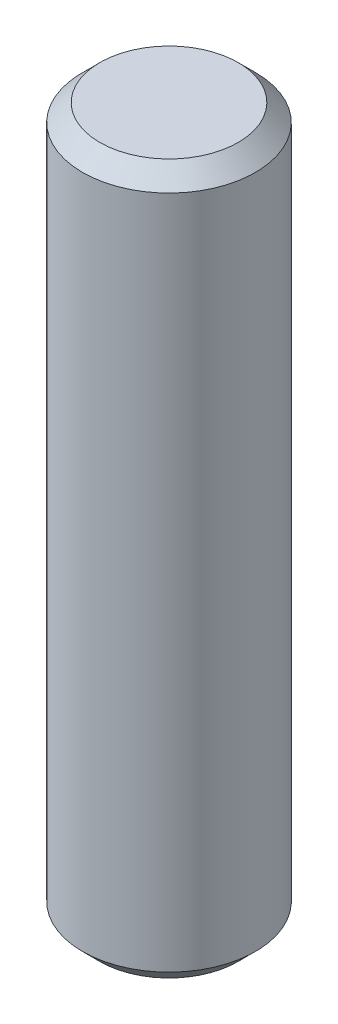
ISO-10303-21;
HEADER;
FILE_DESCRIPTION(('STEP AP214'),'2;1');
FILE_NAME('part.step','',(''),(''),'','','');
FILE_SCHEMA(('AUTOMOTIVE_DESIGN { 1 0 10303 214 1 1 1 1 }'));
ENDSEC;
DATA;
#1=APPLICATION_CONTEXT('core data for automotive mechanical design processes');
#2=APPLICATION_PROTOCOL_DEFINITION('international standard','automotive_design',2000,#1);
#3=PRODUCT_CONTEXT('',#1,'mechanical');
#4=PRODUCT('Part','Part','',(#3));
#5=PRODUCT_RELATED_PRODUCT_CATEGORY('part','',(#4));
#6=PRODUCT_DEFINITION_FORMATION('','',#4);
#7=PRODUCT_DEFINITION_CONTEXT('part definition',#1,'design');
#8=PRODUCT_DEFINITION('design','',#6,#7);
#9=PRODUCT_DEFINITION_SHAPE('','',#8);
#10=(LENGTH_UNIT() NAMED_UNIT(*) SI_UNIT(.MILLI.,.METRE.));
#11=(NAMED_UNIT(*) PLANE_ANGLE_UNIT() SI_UNIT($,.RADIAN.));
#12=(NAMED_UNIT(*) SI_UNIT($,.STERADIAN.) SOLID_ANGLE_UNIT());
#13=UNCERTAINTY_MEASURE_WITH_UNIT(LENGTH_MEASURE(1.E-05),#10,'distance_accuracy_value','');
#14=(GEOMETRIC_REPRESENTATION_CONTEXT(3) GLOBAL_UNCERTAINTY_ASSIGNED_CONTEXT((#13)) GLOBAL_UNIT_ASSIGNED_CONTEXT((#10,
#11,#12)) REPRESENTATION_CONTEXT('',''));
#15=CARTESIAN_POINT('',(0.,0.,0.));
#16=DIRECTION('',(0.,0.,1.));
#17=DIRECTION('',(1.,0.,0.));
#18=AXIS2_PLACEMENT_3D('',#15,#16,#17);
#19=CARTESIAN_POINT('',(4.,0.,0.));
#20=DIRECTION('',(0.,1.,0.));
#21=DIRECTION('',(0.,0.,1.));
#22=AXIS2_PLACEMENT_3D('',#19,#20,#21);
#23=PLANE('',#22);
#24=CARTESIAN_POINT('',(0.,0.,0.));
#25=DIRECTION('',(0.,1.,0.));
#26=DIRECTION('',(0.,0.,1.));
#27=AXIS2_PLACEMENT_3D('',#24,#25,#26);
#28=CIRCLE('',#27,4.);
#29=CARTESIAN_POINT('',(0.,0.,4.));
#30=VERTEX_POINT('',#29);
#31=EDGE_CURVE('E57',#30,#30,#28,.T.);
#32=ORIENTED_EDGE('',*,*,#31,.F.);
#33=EDGE_LOOP('',(#32));
#34=FACE_BOUND('',#33,.T.);
#35=ADVANCED_FACE('F43',(#34),#23,.F.);
#36=CARTESIAN_POINT('',(0.,41.,0.));
#37=DIRECTION('',(0.,-1.,0.));
#38=DIRECTION('',(0.,0.,-1.));
#39=AXIS2_PLACEMENT_3D('',#36,#37,#38);
#40=PLANE('',#39);
#41=CARTESIAN_POINT('',(0.,41.,0.));
#42=DIRECTION('',(0.,1.,0.));
#43=DIRECTION('',(0.,0.,1.));
#44=AXIS2_PLACEMENT_3D('',#41,#42,#43);
#45=CIRCLE('',#44,3.99999999999999);
#46=CARTESIAN_POINT('',(0.,41.,3.99999999999999));
#47=VERTEX_POINT('',#46);
#48=EDGE_CURVE('E10',#47,#47,#45,.T.);
#49=ORIENTED_EDGE('',*,*,#48,.T.);
#50=EDGE_LOOP('',(#49));
#51=FACE_BOUND('',#50,.T.);
#52=ADVANCED_FACE('F66',(#51),#40,.F.);
#53=CARTESIAN_POINT('',(0.,40.,0.));
#54=DIRECTION('',(0.,-1.,0.));
#55=DIRECTION('',(0.,0.,-1.));
#56=AXIS2_PLACEMENT_3D('',#53,#54,#55);
#57=CONICAL_SURFACE('',#56,4.99999999999999,0.785398163397447);
#58=ORIENTED_EDGE('',*,*,#48,.F.);
#59=EDGE_LOOP('',(#58));
#60=FACE_BOUND('',#59,.T.);
#61=CARTESIAN_POINT('',(0.,40.,0.));
#62=DIRECTION('',(0.,1.,0.));
#63=DIRECTION('',(0.,0.,1.));
#64=AXIS2_PLACEMENT_3D('',#61,#62,#63);
#65=CIRCLE('',#64,4.99999999999999);
#66=CARTESIAN_POINT('',(0.,40.,4.99999999999999));
#67=VERTEX_POINT('',#66);
#68=EDGE_CURVE('E49',#67,#67,#65,.T.);
#69=ORIENTED_EDGE('',*,*,#68,.T.);
#70=EDGE_LOOP('',(#69));
#71=FACE_BOUND('',#70,.T.);
#72=ADVANCED_FACE('F70',(#60,#71),#57,.T.);
#73=CARTESIAN_POINT('',(0.,0.,0.));
#74=DIRECTION('',(0.,1.,0.));
#75=DIRECTION('',(0.,0.,1.));
#76=AXIS2_PLACEMENT_3D('',#73,#74,#75);
#77=CYLINDRICAL_SURFACE('',#76,5.);
#78=ORIENTED_EDGE('',*,*,#68,.F.);
#79=EDGE_LOOP('',(#78));
#80=FACE_BOUND('',#79,.T.);
#81=CARTESIAN_POINT('',(0.,1.,0.));
#82=DIRECTION('',(0.,1.,0.));
#83=DIRECTION('',(0.,0.,1.));
#84=AXIS2_PLACEMENT_3D('',#81,#82,#83);
#85=CIRCLE('',#84,5.);
#86=CARTESIAN_POINT('',(0.,1.,5.));
#87=VERTEX_POINT('',#86);
#88=EDGE_CURVE('E53',#87,#87,#85,.T.);
#89=ORIENTED_EDGE('',*,*,#88,.T.);
#90=EDGE_LOOP('',(#89));
#91=FACE_BOUND('',#90,.T.);
#92=ADVANCED_FACE('F74',(#80,#91),#77,.T.);
#93=CARTESIAN_POINT('',(0.,0.,0.));
#94=DIRECTION('',(0.,1.,0.));
#95=DIRECTION('',(0.,0.,1.));
#96=AXIS2_PLACEMENT_3D('',#93,#94,#95);
#97=CONICAL_SURFACE('',#96,4.,0.785398163397449);
#98=ORIENTED_EDGE('',*,*,#88,.F.);
#99=EDGE_LOOP('',(#98));
#100=FACE_BOUND('',#99,.T.);
#101=ORIENTED_EDGE('',*,*,#31,.T.);
#102=EDGE_LOOP('',(#101));
#103=FACE_BOUND('',#102,.T.);
#104=ADVANCED_FACE('F63',(#100,#103),#97,.T.);
#105=CLOSED_SHELL('',(#35,#52,#72,#92,#104));
#106=MANIFOLD_SOLID_BREP('B2',#105);
#107=ADVANCED_BREP_SHAPE_REPRESENTATION('',(#18,#106),#14);
#108=SHAPE_DEFINITION_REPRESENTATION(#9,#107);
ENDSEC;
END-ISO-10303-21;
